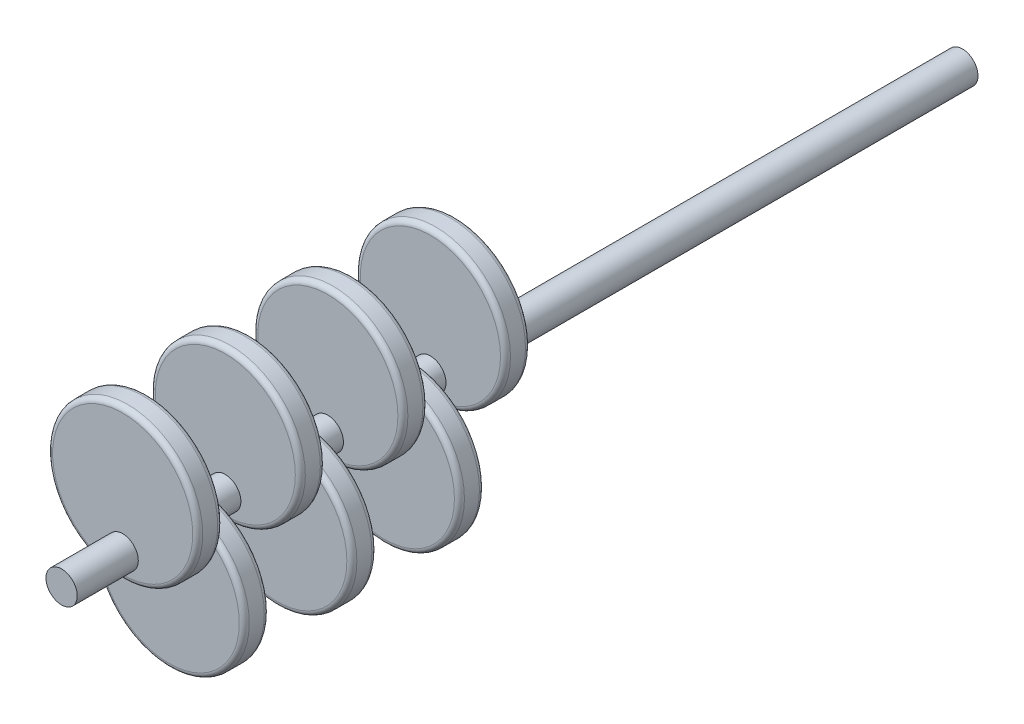
ISO-10303-21;
HEADER;
FILE_DESCRIPTION(('STEP AP214'),'2;1');
FILE_NAME('part.step','',(''),(''),'','','');
FILE_SCHEMA(('AUTOMOTIVE_DESIGN { 1 0 10303 214 1 1 1 1 }'));
ENDSEC;
DATA;
#1=APPLICATION_CONTEXT('core data for automotive mechanical design processes');
#2=APPLICATION_PROTOCOL_DEFINITION('international standard','automotive_design',2000,#1);
#3=PRODUCT_CONTEXT('',#1,'mechanical');
#4=PRODUCT('Part','Part','',(#3));
#5=PRODUCT_RELATED_PRODUCT_CATEGORY('part','',(#4));
#6=PRODUCT_DEFINITION_FORMATION('','',#4);
#7=PRODUCT_DEFINITION_CONTEXT('part definition',#1,'design');
#8=PRODUCT_DEFINITION('design','',#6,#7);
#9=PRODUCT_DEFINITION_SHAPE('','',#8);
#10=(LENGTH_UNIT() NAMED_UNIT(*) SI_UNIT(.MILLI.,.METRE.));
#11=(NAMED_UNIT(*) PLANE_ANGLE_UNIT() SI_UNIT($,.RADIAN.));
#12=(NAMED_UNIT(*) SI_UNIT($,.STERADIAN.) SOLID_ANGLE_UNIT());
#13=UNCERTAINTY_MEASURE_WITH_UNIT(LENGTH_MEASURE(1.E-05),#10,'distance_accuracy_value','');
#14=(GEOMETRIC_REPRESENTATION_CONTEXT(3) GLOBAL_UNCERTAINTY_ASSIGNED_CONTEXT((#13)) GLOBAL_UNIT_ASSIGNED_CONTEXT((#10,
#11,#12)) REPRESENTATION_CONTEXT('',''));
#15=CARTESIAN_POINT('',(0.,0.,0.));
#16=DIRECTION('',(0.,0.,1.));
#17=DIRECTION('',(1.,0.,0.));
#18=AXIS2_PLACEMENT_3D('',#15,#16,#17);
#19=CARTESIAN_POINT('',(0.,0.,90.));
#20=DIRECTION('',(0.,0.,-1.));
#21=DIRECTION('',(-1.,0.,0.));
#22=AXIS2_PLACEMENT_3D('',#19,#20,#21);
#23=CYLINDRICAL_SURFACE('',#22,3.125);
#24=CARTESIAN_POINT('',(0.,0.,57.3));
#25=DIRECTION('',(0.,0.,1.));
#26=DIRECTION('',(1.,0.,0.));
#27=AXIS2_PLACEMENT_3D('',#24,#25,#26);
#28=CIRCLE('',#27,3.125);
#29=CARTESIAN_POINT('',(3.125,0.,57.3));
#30=VERTEX_POINT('',#29);
#31=EDGE_CURVE('E156',#30,#30,#28,.T.);
#32=ORIENTED_EDGE('',*,*,#31,.T.);
#33=EDGE_LOOP('',(#32));
#34=FACE_BOUND('',#33,.T.);
#35=CARTESIAN_POINT('',(0.,0.,63.5));
#36=DIRECTION('',(0.,0.,1.));
#37=DIRECTION('',(1.,0.,0.));
#38=AXIS2_PLACEMENT_3D('',#35,#36,#37);
#39=CIRCLE('',#38,3.125);
#40=CARTESIAN_POINT('',(3.125,0.,63.5));
#41=VERTEX_POINT('',#40);
#42=EDGE_CURVE('E135',#41,#41,#39,.T.);
#43=ORIENTED_EDGE('',*,*,#42,.F.);
#44=EDGE_LOOP('',(#43));
#45=FACE_BOUND('',#44,.T.);
#46=ADVANCED_FACE('F33',(#34,#45),#23,.T.);
#47=CARTESIAN_POINT('',(0.,10.,52.3));
#48=DIRECTION('',(0.,0.,1.));
#49=DIRECTION('',(1.,0.,0.));
#50=AXIS2_PLACEMENT_3D('',#47,#48,#49);
#51=CYLINDRICAL_SURFACE('',#50,15.);
#52=CARTESIAN_POINT('',(0.,10.,53.3));
#53=DIRECTION('',(0.,0.,1.));
#54=DIRECTION('',(1.,0.,0.));
#55=AXIS2_PLACEMENT_3D('',#52,#53,#54);
#56=CIRCLE('',#55,15.);
#57=CARTESIAN_POINT('',(15.,10.,53.3));
#58=VERTEX_POINT('',#57);
#59=EDGE_CURVE('E71',#58,#58,#56,.T.);
#60=ORIENTED_EDGE('',*,*,#59,.T.);
#61=EDGE_LOOP('',(#60));
#62=FACE_BOUND('',#61,.T.);
#63=CARTESIAN_POINT('',(0.,10.,56.3));
#64=DIRECTION('',(0.,0.,1.));
#65=DIRECTION('',(1.,0.,0.));
#66=AXIS2_PLACEMENT_3D('',#63,#64,#65);
#67=CIRCLE('',#66,15.);
#68=CARTESIAN_POINT('',(15.,10.,56.3));
#69=VERTEX_POINT('',#68);
#70=EDGE_CURVE('E74',#69,#69,#67,.F.);
#71=ORIENTED_EDGE('',*,*,#70,.T.);
#72=EDGE_LOOP('',(#71));
#73=FACE_BOUND('',#72,.T.);
#74=ADVANCED_FACE('F204',(#62,#73),#51,.T.);
#75=CARTESIAN_POINT('',(0.,10.,52.3));
#76=DIRECTION('',(0.,0.,1.));
#77=DIRECTION('',(1.,0.,0.));
#78=AXIS2_PLACEMENT_3D('',#75,#76,#77);
#79=PLANE('',#78);
#80=CARTESIAN_POINT('',(0.,10.,52.3));
#81=DIRECTION('',(0.,0.,1.));
#82=DIRECTION('',(1.,0.,0.));
#83=AXIS2_PLACEMENT_3D('',#80,#81,#82);
#84=CIRCLE('',#83,14.);
#85=CARTESIAN_POINT('',(14.,10.,52.3));
#86=VERTEX_POINT('',#85);
#87=EDGE_CURVE('E68',#86,#86,#84,.F.);
#88=ORIENTED_EDGE('',*,*,#87,.T.);
#89=EDGE_LOOP('',(#88));
#90=FACE_BOUND('',#89,.T.);
#91=CARTESIAN_POINT('',(0.,0.,52.3));
#92=DIRECTION('',(0.,0.,1.));
#93=DIRECTION('',(1.,0.,0.));
#94=AXIS2_PLACEMENT_3D('',#91,#92,#93);
#95=CIRCLE('',#94,3.125);
#96=CARTESIAN_POINT('',(3.125,0.,52.3));
#97=VERTEX_POINT('',#96);
#98=EDGE_CURVE('E153',#97,#97,#95,.T.);
#99=ORIENTED_EDGE('',*,*,#98,.T.);
#100=EDGE_LOOP('',(#99));
#101=FACE_BOUND('',#100,.T.);
#102=ADVANCED_FACE('F210',(#90,#101),#79,.F.);
#103=CARTESIAN_POINT('',(0.,10.,57.3));
#104=DIRECTION('',(0.,0.,1.));
#105=DIRECTION('',(1.,0.,0.));
#106=AXIS2_PLACEMENT_3D('',#103,#104,#105);
#107=PLANE('',#106);
#108=CARTESIAN_POINT('',(0.,10.,57.3));
#109=DIRECTION('',(0.,0.,1.));
#110=DIRECTION('',(1.,0.,0.));
#111=AXIS2_PLACEMENT_3D('',#108,#109,#110);
#112=CIRCLE('',#111,14.);
#113=CARTESIAN_POINT('',(14.,10.,57.3));
#114=VERTEX_POINT('',#113);
#115=EDGE_CURVE('E65',#114,#114,#112,.T.);
#116=ORIENTED_EDGE('',*,*,#115,.T.);
#117=EDGE_LOOP('',(#116));
#118=FACE_BOUND('',#117,.T.);
#119=ORIENTED_EDGE('',*,*,#31,.F.);
#120=EDGE_LOOP('',(#119));
#121=FACE_BOUND('',#120,.T.);
#122=ADVANCED_FACE('F282',(#118,#121),#107,.T.);
#123=CARTESIAN_POINT('',(0.,0.,47.));
#124=DIRECTION('',(0.,0.,1.));
#125=DIRECTION('',(1.,0.,0.));
#126=AXIS2_PLACEMENT_3D('',#123,#124,#125);
#127=CIRCLE('',#126,3.125);
#128=CARTESIAN_POINT('',(3.125,0.,47.));
#129=VERTEX_POINT('',#128);
#130=EDGE_CURVE('E132',#129,#129,#127,.T.);
#131=ORIENTED_EDGE('',*,*,#130,.T.);
#132=EDGE_LOOP('',(#131));
#133=FACE_BOUND('',#132,.T.);
#134=ORIENTED_EDGE('',*,*,#98,.F.);
#135=EDGE_LOOP('',(#134));
#136=FACE_BOUND('',#135,.T.);
#137=ADVANCED_FACE('F202',(#133,#136),#23,.T.);
#138=CARTESIAN_POINT('',(0.,-10.,63.5));
#139=DIRECTION('',(0.,0.,1.));
#140=DIRECTION('',(1.,0.,0.));
#141=AXIS2_PLACEMENT_3D('',#138,#139,#140);
#142=CYLINDRICAL_SURFACE('',#141,15.);
#143=CARTESIAN_POINT('',(0.,-10.,64.5));
#144=DIRECTION('',(0.,0.,1.));
#145=DIRECTION('',(1.,0.,0.));
#146=AXIS2_PLACEMENT_3D('',#143,#144,#145);
#147=CIRCLE('',#146,15.);
#148=CARTESIAN_POINT('',(15.,-10.,64.5));
#149=VERTEX_POINT('',#148);
#150=EDGE_CURVE('E59',#149,#149,#147,.T.);
#151=ORIENTED_EDGE('',*,*,#150,.T.);
#152=EDGE_LOOP('',(#151));
#153=FACE_BOUND('',#152,.T.);
#154=CARTESIAN_POINT('',(0.,-10.,67.5));
#155=DIRECTION('',(0.,0.,1.));
#156=DIRECTION('',(1.,0.,0.));
#157=AXIS2_PLACEMENT_3D('',#154,#155,#156);
#158=CIRCLE('',#157,15.);
#159=CARTESIAN_POINT('',(15.,-10.,67.5));
#160=VERTEX_POINT('',#159);
#161=EDGE_CURVE('E62',#160,#160,#158,.F.);
#162=ORIENTED_EDGE('',*,*,#161,.T.);
#163=EDGE_LOOP('',(#162));
#164=FACE_BOUND('',#163,.T.);
#165=ADVANCED_FACE('F255',(#153,#164),#142,.T.);
#166=CARTESIAN_POINT('',(0.,-10.,63.5));
#167=DIRECTION('',(0.,0.,1.));
#168=DIRECTION('',(1.,0.,0.));
#169=AXIS2_PLACEMENT_3D('',#166,#167,#168);
#170=PLANE('',#169);
#171=CARTESIAN_POINT('',(0.,-10.,63.5));
#172=DIRECTION('',(0.,0.,1.));
#173=DIRECTION('',(1.,0.,0.));
#174=AXIS2_PLACEMENT_3D('',#171,#172,#173);
#175=CIRCLE('',#174,14.);
#176=CARTESIAN_POINT('',(14.,-10.,63.5));
#177=VERTEX_POINT('',#176);
#178=EDGE_CURVE('E56',#177,#177,#175,.F.);
#179=ORIENTED_EDGE('',*,*,#178,.T.);
#180=EDGE_LOOP('',(#179));
#181=FACE_BOUND('',#180,.T.);
#182=ORIENTED_EDGE('',*,*,#42,.T.);
#183=EDGE_LOOP('',(#182));
#184=FACE_BOUND('',#183,.T.);
#185=ADVANCED_FACE('F252',(#181,#184),#170,.F.);
#186=CARTESIAN_POINT('',(0.,-10.,68.5));
#187=DIRECTION('',(0.,0.,1.));
#188=DIRECTION('',(1.,0.,0.));
#189=AXIS2_PLACEMENT_3D('',#186,#187,#188);
#190=PLANE('',#189);
#191=CARTESIAN_POINT('',(0.,-10.,68.5));
#192=DIRECTION('',(0.,0.,1.));
#193=DIRECTION('',(1.,0.,0.));
#194=AXIS2_PLACEMENT_3D('',#191,#192,#193);
#195=CIRCLE('',#194,14.);
#196=CARTESIAN_POINT('',(14.,-10.,68.5));
#197=VERTEX_POINT('',#196);
#198=EDGE_CURVE('E53',#197,#197,#195,.T.);
#199=ORIENTED_EDGE('',*,*,#198,.T.);
#200=EDGE_LOOP('',(#199));
#201=FACE_BOUND('',#200,.T.);
#202=CARTESIAN_POINT('',(0.,0.,68.5));
#203=DIRECTION('',(0.,0.,1.));
#204=DIRECTION('',(1.,0.,0.));
#205=AXIS2_PLACEMENT_3D('',#202,#203,#204);
#206=CIRCLE('',#205,3.125);
#207=CARTESIAN_POINT('',(3.125,0.,68.5));
#208=VERTEX_POINT('',#207);
#209=EDGE_CURVE('E138',#208,#208,#206,.T.);
#210=ORIENTED_EDGE('',*,*,#209,.F.);
#211=EDGE_LOOP('',(#210));
#212=FACE_BOUND('',#211,.T.);
#213=ADVANCED_FACE('F189',(#201,#212),#190,.T.);
#214=CARTESIAN_POINT('',(0.,0.,90.));
#215=DIRECTION('',(0.,0.,1.));
#216=DIRECTION('',(1.,0.,0.));
#217=AXIS2_PLACEMENT_3D('',#214,#215,#216);
#218=PLANE('',#217);
#219=CARTESIAN_POINT('',(0.,0.,90.));
#220=DIRECTION('',(0.,0.,1.));
#221=DIRECTION('',(1.,0.,0.));
#222=AXIS2_PLACEMENT_3D('',#219,#220,#221);
#223=CIRCLE('',#222,3.125);
#224=CARTESIAN_POINT('',(3.125,0.,90.));
#225=VERTEX_POINT('',#224);
#226=EDGE_CURVE('E165',#225,#225,#223,.T.);
#227=ORIENTED_EDGE('',*,*,#226,.T.);
#228=EDGE_LOOP('',(#227));
#229=FACE_BOUND('',#228,.T.);
#230=ADVANCED_FACE('F174',(#229),#218,.T.);
#231=CARTESIAN_POINT('',(0.,0.,77.8));
#232=DIRECTION('',(0.,0.,1.));
#233=DIRECTION('',(1.,0.,0.));
#234=AXIS2_PLACEMENT_3D('',#231,#232,#233);
#235=CIRCLE('',#234,3.125);
#236=CARTESIAN_POINT('',(3.125,0.,77.8));
#237=VERTEX_POINT('',#236);
#238=EDGE_CURVE('E162',#237,#237,#235,.T.);
#239=ORIENTED_EDGE('',*,*,#238,.T.);
#240=EDGE_LOOP('',(#239));
#241=FACE_BOUND('',#240,.T.);
#242=ORIENTED_EDGE('',*,*,#226,.F.);
#243=EDGE_LOOP('',(#242));
#244=FACE_BOUND('',#243,.T.);
#245=ADVANCED_FACE('F176',(#241,#244),#23,.T.);
#246=CARTESIAN_POINT('',(0.,10.,77.8));
#247=DIRECTION('',(0.,0.,1.));
#248=DIRECTION('',(1.,0.,0.));
#249=AXIS2_PLACEMENT_3D('',#246,#247,#248);
#250=PLANE('',#249);
#251=CARTESIAN_POINT('',(0.,10.,77.8));
#252=DIRECTION('',(0.,0.,1.));
#253=DIRECTION('',(1.,0.,0.));
#254=AXIS2_PLACEMENT_3D('',#251,#252,#253);
#255=CIRCLE('',#254,14.);
#256=CARTESIAN_POINT('',(14.,10.,77.8));
#257=VERTEX_POINT('',#256);
#258=EDGE_CURVE('E10',#257,#257,#255,.T.);
#259=ORIENTED_EDGE('',*,*,#258,.T.);
#260=EDGE_LOOP('',(#259));
#261=FACE_BOUND('',#260,.T.);
#262=ORIENTED_EDGE('',*,*,#238,.F.);
#263=EDGE_LOOP('',(#262));
#264=FACE_BOUND('',#263,.T.);
#265=ADVANCED_FACE('F178',(#261,#264),#250,.T.);
#266=CARTESIAN_POINT('',(0.,10.,72.8));
#267=DIRECTION('',(0.,0.,1.));
#268=DIRECTION('',(1.,0.,0.));
#269=AXIS2_PLACEMENT_3D('',#266,#267,#268);
#270=CYLINDRICAL_SURFACE('',#269,15.);
#271=CARTESIAN_POINT('',(0.,10.,73.8));
#272=DIRECTION('',(0.,0.,1.));
#273=DIRECTION('',(1.,0.,0.));
#274=AXIS2_PLACEMENT_3D('',#271,#272,#273);
#275=CIRCLE('',#274,15.);
#276=CARTESIAN_POINT('',(15.,10.,73.8));
#277=VERTEX_POINT('',#276);
#278=EDGE_CURVE('E44',#277,#277,#275,.T.);
#279=ORIENTED_EDGE('',*,*,#278,.T.);
#280=EDGE_LOOP('',(#279));
#281=FACE_BOUND('',#280,.T.);
#282=CARTESIAN_POINT('',(0.,10.,76.8));
#283=DIRECTION('',(0.,0.,1.));
#284=DIRECTION('',(1.,0.,0.));
#285=AXIS2_PLACEMENT_3D('',#282,#283,#284);
#286=CIRCLE('',#285,15.);
#287=CARTESIAN_POINT('',(15.,10.,76.8));
#288=VERTEX_POINT('',#287);
#289=EDGE_CURVE('E48',#288,#288,#286,.F.);
#290=ORIENTED_EDGE('',*,*,#289,.T.);
#291=EDGE_LOOP('',(#290));
#292=FACE_BOUND('',#291,.T.);
#293=ADVANCED_FACE('F187',(#281,#292),#270,.T.);
#294=CARTESIAN_POINT('',(0.,10.,72.8));
#295=DIRECTION('',(0.,0.,1.));
#296=DIRECTION('',(1.,0.,0.));
#297=AXIS2_PLACEMENT_3D('',#294,#295,#296);
#298=PLANE('',#297);
#299=CARTESIAN_POINT('',(0.,10.,72.8));
#300=DIRECTION('',(0.,0.,1.));
#301=DIRECTION('',(1.,0.,0.));
#302=AXIS2_PLACEMENT_3D('',#299,#300,#301);
#303=CIRCLE('',#302,14.);
#304=CARTESIAN_POINT('',(14.,10.,72.8));
#305=VERTEX_POINT('',#304);
#306=EDGE_CURVE('E40',#305,#305,#303,.F.);
#307=ORIENTED_EDGE('',*,*,#306,.T.);
#308=EDGE_LOOP('',(#307));
#309=FACE_BOUND('',#308,.T.);
#310=CARTESIAN_POINT('',(0.,0.,72.8));
#311=DIRECTION('',(0.,0.,1.));
#312=DIRECTION('',(1.,0.,0.));
#313=AXIS2_PLACEMENT_3D('',#310,#311,#312);
#314=CIRCLE('',#313,3.125);
#315=CARTESIAN_POINT('',(3.125,0.,72.8));
#316=VERTEX_POINT('',#315);
#317=EDGE_CURVE('E159',#316,#316,#314,.T.);
#318=ORIENTED_EDGE('',*,*,#317,.T.);
#319=EDGE_LOOP('',(#318));
#320=FACE_BOUND('',#319,.T.);
#321=ADVANCED_FACE('F200',(#309,#320),#298,.F.);
#322=ORIENTED_EDGE('',*,*,#209,.T.);
#323=EDGE_LOOP('',(#322));
#324=FACE_BOUND('',#323,.T.);
#325=ORIENTED_EDGE('',*,*,#317,.F.);
#326=EDGE_LOOP('',(#325));
#327=FACE_BOUND('',#326,.T.);
#328=ADVANCED_FACE('F182',(#324,#327),#23,.T.);
#329=CARTESIAN_POINT('',(0.,-10.,42.));
#330=DIRECTION('',(0.,0.,1.));
#331=DIRECTION('',(1.,0.,0.));
#332=AXIS2_PLACEMENT_3D('',#329,#330,#331);
#333=CYLINDRICAL_SURFACE('',#332,15.);
#334=CARTESIAN_POINT('',(0.,-10.,43.));
#335=DIRECTION('',(0.,0.,1.));
#336=DIRECTION('',(1.,0.,0.));
#337=AXIS2_PLACEMENT_3D('',#334,#335,#336);
#338=CIRCLE('',#337,15.);
#339=CARTESIAN_POINT('',(15.,-10.,43.));
#340=VERTEX_POINT('',#339);
#341=EDGE_CURVE('E83',#340,#340,#338,.T.);
#342=ORIENTED_EDGE('',*,*,#341,.T.);
#343=EDGE_LOOP('',(#342));
#344=FACE_BOUND('',#343,.T.);
#345=CARTESIAN_POINT('',(0.,-10.,46.));
#346=DIRECTION('',(0.,0.,1.));
#347=DIRECTION('',(1.,0.,0.));
#348=AXIS2_PLACEMENT_3D('',#345,#346,#347);
#349=CIRCLE('',#348,15.);
#350=CARTESIAN_POINT('',(15.,-10.,46.));
#351=VERTEX_POINT('',#350);
#352=EDGE_CURVE('E86',#351,#351,#349,.F.);
#353=ORIENTED_EDGE('',*,*,#352,.T.);
#354=EDGE_LOOP('',(#353));
#355=FACE_BOUND('',#354,.T.);
#356=ADVANCED_FACE('F199',(#344,#355),#333,.T.);
#357=CARTESIAN_POINT('',(0.,-10.,42.));
#358=DIRECTION('',(0.,0.,1.));
#359=DIRECTION('',(1.,0.,0.));
#360=AXIS2_PLACEMENT_3D('',#357,#358,#359);
#361=PLANE('',#360);
#362=CARTESIAN_POINT('',(0.,-10.,42.));
#363=DIRECTION('',(0.,0.,1.));
#364=DIRECTION('',(1.,0.,0.));
#365=AXIS2_PLACEMENT_3D('',#362,#363,#364);
#366=CIRCLE('',#365,14.);
#367=CARTESIAN_POINT('',(14.,-10.,42.));
#368=VERTEX_POINT('',#367);
#369=EDGE_CURVE('E80',#368,#368,#366,.F.);
#370=ORIENTED_EDGE('',*,*,#369,.T.);
#371=EDGE_LOOP('',(#370));
#372=FACE_BOUND('',#371,.T.);
#373=CARTESIAN_POINT('',(0.,0.,42.));
#374=DIRECTION('',(0.,0.,1.));
#375=DIRECTION('',(1.,0.,0.));
#376=AXIS2_PLACEMENT_3D('',#373,#374,#375);
#377=CIRCLE('',#376,3.125);
#378=CARTESIAN_POINT('',(3.125,0.,42.));
#379=VERTEX_POINT('',#378);
#380=EDGE_CURVE('E128',#379,#379,#377,.T.);
#381=ORIENTED_EDGE('',*,*,#380,.T.);
#382=EDGE_LOOP('',(#381));
#383=FACE_BOUND('',#382,.T.);
#384=ADVANCED_FACE('F237',(#372,#383),#361,.F.);
#385=CARTESIAN_POINT('',(0.,-10.,47.));
#386=DIRECTION('',(0.,0.,1.));
#387=DIRECTION('',(1.,0.,0.));
#388=AXIS2_PLACEMENT_3D('',#385,#386,#387);
#389=PLANE('',#388);
#390=CARTESIAN_POINT('',(0.,-10.,47.));
#391=DIRECTION('',(0.,0.,1.));
#392=DIRECTION('',(1.,0.,0.));
#393=AXIS2_PLACEMENT_3D('',#390,#391,#392);
#394=CIRCLE('',#393,14.);
#395=CARTESIAN_POINT('',(14.,-10.,47.));
#396=VERTEX_POINT('',#395);
#397=EDGE_CURVE('E77',#396,#396,#394,.T.);
#398=ORIENTED_EDGE('',*,*,#397,.T.);
#399=EDGE_LOOP('',(#398));
#400=FACE_BOUND('',#399,.T.);
#401=ORIENTED_EDGE('',*,*,#130,.F.);
#402=EDGE_LOOP('',(#401));
#403=FACE_BOUND('',#402,.T.);
#404=ADVANCED_FACE('F239',(#400,#403),#389,.T.);
#405=CARTESIAN_POINT('',(0.,0.,25.5));
#406=DIRECTION('',(0.,0.,1.));
#407=DIRECTION('',(1.,0.,0.));
#408=AXIS2_PLACEMENT_3D('',#405,#406,#407);
#409=CIRCLE('',#408,3.125);
#410=CARTESIAN_POINT('',(3.125,0.,25.5));
#411=VERTEX_POINT('',#410);
#412=EDGE_CURVE('E129',#411,#411,#409,.T.);
#413=ORIENTED_EDGE('',*,*,#412,.T.);
#414=EDGE_LOOP('',(#413));
#415=FACE_BOUND('',#414,.T.);
#416=CARTESIAN_POINT('',(0.,0.,31.8));
#417=DIRECTION('',(0.,0.,1.));
#418=DIRECTION('',(1.,0.,0.));
#419=AXIS2_PLACEMENT_3D('',#416,#417,#418);
#420=CIRCLE('',#419,3.125);
#421=CARTESIAN_POINT('',(3.125,0.,31.8));
#422=VERTEX_POINT('',#421);
#423=EDGE_CURVE('E147',#422,#422,#420,.T.);
#424=ORIENTED_EDGE('',*,*,#423,.F.);
#425=EDGE_LOOP('',(#424));
#426=FACE_BOUND('',#425,.T.);
#427=ADVANCED_FACE('F218',(#415,#426),#23,.T.);
#428=CARTESIAN_POINT('',(0.,10.,31.8));
#429=DIRECTION('',(0.,0.,1.));
#430=DIRECTION('',(1.,0.,0.));
#431=AXIS2_PLACEMENT_3D('',#428,#429,#430);
#432=PLANE('',#431);
#433=CARTESIAN_POINT('',(0.,10.,31.8));
#434=DIRECTION('',(0.,0.,1.));
#435=DIRECTION('',(1.,0.,0.));
#436=AXIS2_PLACEMENT_3D('',#433,#434,#435);
#437=CIRCLE('',#436,14.);
#438=CARTESIAN_POINT('',(14.,10.,31.8));
#439=VERTEX_POINT('',#438);
#440=EDGE_CURVE('E92',#439,#439,#437,.F.);
#441=ORIENTED_EDGE('',*,*,#440,.T.);
#442=EDGE_LOOP('',(#441));
#443=FACE_BOUND('',#442,.T.);
#444=ORIENTED_EDGE('',*,*,#423,.T.);
#445=EDGE_LOOP('',(#444));
#446=FACE_BOUND('',#445,.T.);
#447=ADVANCED_FACE('F273',(#443,#446),#432,.F.);
#448=CARTESIAN_POINT('',(0.,10.,31.8));
#449=DIRECTION('',(0.,0.,1.));
#450=DIRECTION('',(1.,0.,0.));
#451=AXIS2_PLACEMENT_3D('',#448,#449,#450);
#452=CYLINDRICAL_SURFACE('',#451,15.);
#453=CARTESIAN_POINT('',(0.,10.,32.8));
#454=DIRECTION('',(0.,0.,1.));
#455=DIRECTION('',(1.,0.,0.));
#456=AXIS2_PLACEMENT_3D('',#453,#454,#455);
#457=CIRCLE('',#456,15.);
#458=CARTESIAN_POINT('',(15.,10.,32.8));
#459=VERTEX_POINT('',#458);
#460=EDGE_CURVE('E95',#459,#459,#457,.T.);
#461=ORIENTED_EDGE('',*,*,#460,.T.);
#462=EDGE_LOOP('',(#461));
#463=FACE_BOUND('',#462,.T.);
#464=CARTESIAN_POINT('',(0.,10.,35.8));
#465=DIRECTION('',(0.,0.,1.));
#466=DIRECTION('',(1.,0.,0.));
#467=AXIS2_PLACEMENT_3D('',#464,#465,#466);
#468=CIRCLE('',#467,15.);
#469=CARTESIAN_POINT('',(15.,10.,35.8));
#470=VERTEX_POINT('',#469);
#471=EDGE_CURVE('E98',#470,#470,#468,.F.);
#472=ORIENTED_EDGE('',*,*,#471,.T.);
#473=EDGE_LOOP('',(#472));
#474=FACE_BOUND('',#473,.T.);
#475=ADVANCED_FACE('F230',(#463,#474),#452,.T.);
#476=CARTESIAN_POINT('',(0.,10.,36.8));
#477=DIRECTION('',(0.,0.,1.));
#478=DIRECTION('',(1.,0.,0.));
#479=AXIS2_PLACEMENT_3D('',#476,#477,#478);
#480=PLANE('',#479);
#481=CARTESIAN_POINT('',(0.,10.,36.8));
#482=DIRECTION('',(0.,0.,1.));
#483=DIRECTION('',(1.,0.,0.));
#484=AXIS2_PLACEMENT_3D('',#481,#482,#483);
#485=CIRCLE('',#484,14.);
#486=CARTESIAN_POINT('',(14.,10.,36.8));
#487=VERTEX_POINT('',#486);
#488=EDGE_CURVE('E89',#487,#487,#485,.T.);
#489=ORIENTED_EDGE('',*,*,#488,.T.);
#490=EDGE_LOOP('',(#489));
#491=FACE_BOUND('',#490,.T.);
#492=CARTESIAN_POINT('',(0.,0.,36.8));
#493=DIRECTION('',(0.,0.,1.));
#494=DIRECTION('',(1.,0.,0.));
#495=AXIS2_PLACEMENT_3D('',#492,#493,#494);
#496=CIRCLE('',#495,3.125);
#497=CARTESIAN_POINT('',(3.125,0.,36.8));
#498=VERTEX_POINT('',#497);
#499=EDGE_CURVE('E150',#498,#498,#496,.T.);
#500=ORIENTED_EDGE('',*,*,#499,.F.);
#501=EDGE_LOOP('',(#500));
#502=FACE_BOUND('',#501,.T.);
#503=ADVANCED_FACE('F221',(#491,#502),#480,.T.);
#504=ORIENTED_EDGE('',*,*,#499,.T.);
#505=EDGE_LOOP('',(#504));
#506=FACE_BOUND('',#505,.T.);
#507=ORIENTED_EDGE('',*,*,#380,.F.);
#508=EDGE_LOOP('',(#507));
#509=FACE_BOUND('',#508,.T.);
#510=ADVANCED_FACE('F197',(#506,#509),#23,.T.);
#511=CARTESIAN_POINT('',(0.,-10.,20.5));
#512=DIRECTION('',(0.,0.,1.));
#513=DIRECTION('',(1.,0.,0.));
#514=AXIS2_PLACEMENT_3D('',#511,#512,#513);
#515=CYLINDRICAL_SURFACE('',#514,15.);
#516=CARTESIAN_POINT('',(0.,-10.,21.5));
#517=DIRECTION('',(0.,0.,1.));
#518=DIRECTION('',(1.,0.,0.));
#519=AXIS2_PLACEMENT_3D('',#516,#517,#518);
#520=CIRCLE('',#519,15.);
#521=CARTESIAN_POINT('',(15.,-10.,21.5));
#522=VERTEX_POINT('',#521);
#523=EDGE_CURVE('E107',#522,#522,#520,.T.);
#524=ORIENTED_EDGE('',*,*,#523,.T.);
#525=EDGE_LOOP('',(#524));
#526=FACE_BOUND('',#525,.T.);
#527=CARTESIAN_POINT('',(0.,-10.,24.5));
#528=DIRECTION('',(0.,0.,1.));
#529=DIRECTION('',(1.,0.,0.));
#530=AXIS2_PLACEMENT_3D('',#527,#528,#529);
#531=CIRCLE('',#530,15.);
#532=CARTESIAN_POINT('',(15.,-10.,24.5));
#533=VERTEX_POINT('',#532);
#534=EDGE_CURVE('E110',#533,#533,#531,.F.);
#535=ORIENTED_EDGE('',*,*,#534,.T.);
#536=EDGE_LOOP('',(#535));
#537=FACE_BOUND('',#536,.T.);
#538=ADVANCED_FACE('F220',(#526,#537),#515,.T.);
#539=CARTESIAN_POINT('',(0.,-10.,20.5));
#540=DIRECTION('',(0.,0.,1.));
#541=DIRECTION('',(1.,0.,0.));
#542=AXIS2_PLACEMENT_3D('',#539,#540,#541);
#543=PLANE('',#542);
#544=CARTESIAN_POINT('',(0.,-10.,20.5));
#545=DIRECTION('',(0.,0.,1.));
#546=DIRECTION('',(1.,0.,0.));
#547=AXIS2_PLACEMENT_3D('',#544,#545,#546);
#548=CIRCLE('',#547,14.);
#549=CARTESIAN_POINT('',(14.,-10.,20.5));
#550=VERTEX_POINT('',#549);
#551=EDGE_CURVE('E104',#550,#550,#548,.F.);
#552=ORIENTED_EDGE('',*,*,#551,.T.);
#553=EDGE_LOOP('',(#552));
#554=FACE_BOUND('',#553,.T.);
#555=CARTESIAN_POINT('',(0.,0.,20.5));
#556=DIRECTION('',(0.,0.,1.));
#557=DIRECTION('',(1.,0.,0.));
#558=AXIS2_PLACEMENT_3D('',#555,#556,#557);
#559=CIRCLE('',#558,3.125);
#560=CARTESIAN_POINT('',(3.125,0.,20.5));
#561=VERTEX_POINT('',#560);
#562=EDGE_CURVE('E125',#561,#561,#559,.T.);
#563=ORIENTED_EDGE('',*,*,#562,.T.);
#564=EDGE_LOOP('',(#563));
#565=FACE_BOUND('',#564,.T.);
#566=ADVANCED_FACE('F227',(#554,#565),#543,.F.);
#567=CARTESIAN_POINT('',(0.,-10.,25.5));
#568=DIRECTION('',(0.,0.,1.));
#569=DIRECTION('',(1.,0.,0.));
#570=AXIS2_PLACEMENT_3D('',#567,#568,#569);
#571=PLANE('',#570);
#572=CARTESIAN_POINT('',(0.,-10.,25.5));
#573=DIRECTION('',(0.,0.,1.));
#574=DIRECTION('',(1.,0.,0.));
#575=AXIS2_PLACEMENT_3D('',#572,#573,#574);
#576=CIRCLE('',#575,14.);
#577=CARTESIAN_POINT('',(14.,-10.,25.5));
#578=VERTEX_POINT('',#577);
#579=EDGE_CURVE('E101',#578,#578,#576,.T.);
#580=ORIENTED_EDGE('',*,*,#579,.T.);
#581=EDGE_LOOP('',(#580));
#582=FACE_BOUND('',#581,.T.);
#583=ORIENTED_EDGE('',*,*,#412,.F.);
#584=EDGE_LOOP('',(#583));
#585=FACE_BOUND('',#584,.T.);
#586=ADVANCED_FACE('F292',(#582,#585),#571,.T.);
#587=CARTESIAN_POINT('',(0.,0.,-90.));
#588=DIRECTION('',(0.,0.,1.));
#589=DIRECTION('',(1.,0.,0.));
#590=AXIS2_PLACEMENT_3D('',#587,#588,#589);
#591=PLANE('',#590);
#592=CARTESIAN_POINT('',(0.,0.,-90.));
#593=DIRECTION('',(0.,0.,1.));
#594=DIRECTION('',(1.,0.,0.));
#595=AXIS2_PLACEMENT_3D('',#592,#593,#594);
#596=CIRCLE('',#595,3.125);
#597=CARTESIAN_POINT('',(3.125,0.,-90.));
#598=VERTEX_POINT('',#597);
#599=EDGE_CURVE('E168',#598,#598,#596,.T.);
#600=ORIENTED_EDGE('',*,*,#599,.F.);
#601=EDGE_LOOP('',(#600));
#602=FACE_BOUND('',#601,.T.);
#603=ADVANCED_FACE('F216',(#602),#591,.F.);
#604=ORIENTED_EDGE('',*,*,#599,.T.);
#605=EDGE_LOOP('',(#604));
#606=FACE_BOUND('',#605,.T.);
#607=CARTESIAN_POINT('',(0.,0.,11.3));
#608=DIRECTION('',(0.,0.,1.));
#609=DIRECTION('',(1.,0.,0.));
#610=AXIS2_PLACEMENT_3D('',#607,#608,#609);
#611=CIRCLE('',#610,3.125);
#612=CARTESIAN_POINT('',(3.125,0.,11.3));
#613=VERTEX_POINT('',#612);
#614=EDGE_CURVE('E141',#613,#613,#611,.T.);
#615=ORIENTED_EDGE('',*,*,#614,.F.);
#616=EDGE_LOOP('',(#615));
#617=FACE_BOUND('',#616,.T.);
#618=ADVANCED_FACE('F206',(#606,#617),#23,.T.);
#619=CARTESIAN_POINT('',(0.,10.,11.3));
#620=DIRECTION('',(0.,0.,1.));
#621=DIRECTION('',(1.,0.,0.));
#622=AXIS2_PLACEMENT_3D('',#619,#620,#621);
#623=PLANE('',#622);
#624=CARTESIAN_POINT('',(0.,10.,11.3));
#625=DIRECTION('',(0.,0.,1.));
#626=DIRECTION('',(1.,0.,0.));
#627=AXIS2_PLACEMENT_3D('',#624,#625,#626);
#628=CIRCLE('',#627,14.);
#629=CARTESIAN_POINT('',(14.,10.,11.3));
#630=VERTEX_POINT('',#629);
#631=EDGE_CURVE('E116',#630,#630,#628,.F.);
#632=ORIENTED_EDGE('',*,*,#631,.T.);
#633=EDGE_LOOP('',(#632));
#634=FACE_BOUND('',#633,.T.);
#635=ORIENTED_EDGE('',*,*,#614,.T.);
#636=EDGE_LOOP('',(#635));
#637=FACE_BOUND('',#636,.T.);
#638=ADVANCED_FACE('F215',(#634,#637),#623,.F.);
#639=CARTESIAN_POINT('',(0.,10.,11.3));
#640=DIRECTION('',(0.,0.,1.));
#641=DIRECTION('',(1.,0.,0.));
#642=AXIS2_PLACEMENT_3D('',#639,#640,#641);
#643=CYLINDRICAL_SURFACE('',#642,15.);
#644=CARTESIAN_POINT('',(0.,10.,12.3));
#645=DIRECTION('',(0.,0.,1.));
#646=DIRECTION('',(1.,0.,0.));
#647=AXIS2_PLACEMENT_3D('',#644,#645,#646);
#648=CIRCLE('',#647,15.);
#649=CARTESIAN_POINT('',(15.,10.,12.3));
#650=VERTEX_POINT('',#649);
#651=EDGE_CURVE('E119',#650,#650,#648,.T.);
#652=ORIENTED_EDGE('',*,*,#651,.T.);
#653=EDGE_LOOP('',(#652));
#654=FACE_BOUND('',#653,.T.);
#655=CARTESIAN_POINT('',(0.,10.,15.3));
#656=DIRECTION('',(0.,0.,1.));
#657=DIRECTION('',(1.,0.,0.));
#658=AXIS2_PLACEMENT_3D('',#655,#656,#657);
#659=CIRCLE('',#658,15.);
#660=CARTESIAN_POINT('',(15.,10.,15.3));
#661=VERTEX_POINT('',#660);
#662=EDGE_CURVE('E122',#661,#661,#659,.F.);
#663=ORIENTED_EDGE('',*,*,#662,.T.);
#664=EDGE_LOOP('',(#663));
#665=FACE_BOUND('',#664,.T.);
#666=ADVANCED_FACE('F265',(#654,#665),#643,.T.);
#667=CARTESIAN_POINT('',(0.,10.,16.3));
#668=DIRECTION('',(0.,0.,1.));
#669=DIRECTION('',(1.,0.,0.));
#670=AXIS2_PLACEMENT_3D('',#667,#668,#669);
#671=PLANE('',#670);
#672=CARTESIAN_POINT('',(0.,10.,16.3));
#673=DIRECTION('',(0.,0.,1.));
#674=DIRECTION('',(1.,0.,0.));
#675=AXIS2_PLACEMENT_3D('',#672,#673,#674);
#676=CIRCLE('',#675,14.);
#677=CARTESIAN_POINT('',(14.,10.,16.3));
#678=VERTEX_POINT('',#677);
#679=EDGE_CURVE('E113',#678,#678,#676,.T.);
#680=ORIENTED_EDGE('',*,*,#679,.T.);
#681=EDGE_LOOP('',(#680));
#682=FACE_BOUND('',#681,.T.);
#683=CARTESIAN_POINT('',(0.,0.,16.3));
#684=DIRECTION('',(0.,0.,1.));
#685=DIRECTION('',(1.,0.,0.));
#686=AXIS2_PLACEMENT_3D('',#683,#684,#685);
#687=CIRCLE('',#686,3.125);
#688=CARTESIAN_POINT('',(3.125,0.,16.3));
#689=VERTEX_POINT('',#688);
#690=EDGE_CURVE('E144',#689,#689,#687,.T.);
#691=ORIENTED_EDGE('',*,*,#690,.F.);
#692=EDGE_LOOP('',(#691));
#693=FACE_BOUND('',#692,.T.);
#694=ADVANCED_FACE('F195',(#682,#693),#671,.T.);
#695=ORIENTED_EDGE('',*,*,#690,.T.);
#696=EDGE_LOOP('',(#695));
#697=FACE_BOUND('',#696,.T.);
#698=ORIENTED_EDGE('',*,*,#562,.F.);
#699=EDGE_LOOP('',(#698));
#700=FACE_BOUND('',#699,.T.);
#701=ADVANCED_FACE('F181',(#697,#700),#23,.T.);
#702=CARTESIAN_POINT('',(0.,10.,12.3));
#703=DIRECTION('',(0.,0.,1.));
#704=DIRECTION('',(1.,0.,0.));
#705=AXIS2_PLACEMENT_3D('',#702,#703,#704);
#706=TOROIDAL_SURFACE('',#705,14.,1.);
#707=ORIENTED_EDGE('',*,*,#631,.F.);
#708=EDGE_LOOP('',(#707));
#709=FACE_BOUND('',#708,.T.);
#710=ORIENTED_EDGE('',*,*,#651,.F.);
#711=EDGE_LOOP('',(#710));
#712=FACE_BOUND('',#711,.T.);
#713=ADVANCED_FACE('F194',(#709,#712),#706,.T.);
#714=CARTESIAN_POINT('',(0.,10.,15.3));
#715=DIRECTION('',(0.,0.,1.));
#716=DIRECTION('',(1.,0.,0.));
#717=AXIS2_PLACEMENT_3D('',#714,#715,#716);
#718=TOROIDAL_SURFACE('',#717,14.,1.);
#719=ORIENTED_EDGE('',*,*,#662,.F.);
#720=EDGE_LOOP('',(#719));
#721=FACE_BOUND('',#720,.T.);
#722=ORIENTED_EDGE('',*,*,#679,.F.);
#723=EDGE_LOOP('',(#722));
#724=FACE_BOUND('',#723,.T.);
#725=ADVANCED_FACE('F456',(#721,#724),#718,.T.);
#726=CARTESIAN_POINT('',(0.,-10.,21.5));
#727=DIRECTION('',(0.,0.,1.));
#728=DIRECTION('',(1.,0.,0.));
#729=AXIS2_PLACEMENT_3D('',#726,#727,#728);
#730=TOROIDAL_SURFACE('',#729,14.,1.);
#731=ORIENTED_EDGE('',*,*,#551,.F.);
#732=EDGE_LOOP('',(#731));
#733=FACE_BOUND('',#732,.T.);
#734=ORIENTED_EDGE('',*,*,#523,.F.);
#735=EDGE_LOOP('',(#734));
#736=FACE_BOUND('',#735,.T.);
#737=ADVANCED_FACE('F465',(#733,#736),#730,.T.);
#738=CARTESIAN_POINT('',(0.,-10.,24.5));
#739=DIRECTION('',(0.,0.,1.));
#740=DIRECTION('',(1.,0.,0.));
#741=AXIS2_PLACEMENT_3D('',#738,#739,#740);
#742=TOROIDAL_SURFACE('',#741,14.,1.);
#743=ORIENTED_EDGE('',*,*,#534,.F.);
#744=EDGE_LOOP('',(#743));
#745=FACE_BOUND('',#744,.T.);
#746=ORIENTED_EDGE('',*,*,#579,.F.);
#747=EDGE_LOOP('',(#746));
#748=FACE_BOUND('',#747,.T.);
#749=ADVANCED_FACE('F475',(#745,#748),#742,.T.);
#750=CARTESIAN_POINT('',(0.,10.,32.8));
#751=DIRECTION('',(0.,0.,1.));
#752=DIRECTION('',(1.,0.,0.));
#753=AXIS2_PLACEMENT_3D('',#750,#751,#752);
#754=TOROIDAL_SURFACE('',#753,14.,1.);
#755=ORIENTED_EDGE('',*,*,#440,.F.);
#756=EDGE_LOOP('',(#755));
#757=FACE_BOUND('',#756,.T.);
#758=ORIENTED_EDGE('',*,*,#460,.F.);
#759=EDGE_LOOP('',(#758));
#760=FACE_BOUND('',#759,.T.);
#761=ADVANCED_FACE('F485',(#757,#760),#754,.T.);
#762=CARTESIAN_POINT('',(0.,10.,35.8));
#763=DIRECTION('',(0.,0.,1.));
#764=DIRECTION('',(1.,0.,0.));
#765=AXIS2_PLACEMENT_3D('',#762,#763,#764);
#766=TOROIDAL_SURFACE('',#765,14.,1.);
#767=ORIENTED_EDGE('',*,*,#471,.F.);
#768=EDGE_LOOP('',(#767));
#769=FACE_BOUND('',#768,.T.);
#770=ORIENTED_EDGE('',*,*,#488,.F.);
#771=EDGE_LOOP('',(#770));
#772=FACE_BOUND('',#771,.T.);
#773=ADVANCED_FACE('F495',(#769,#772),#766,.T.);
#774=CARTESIAN_POINT('',(0.,-10.,43.));
#775=DIRECTION('',(0.,0.,1.));
#776=DIRECTION('',(1.,0.,0.));
#777=AXIS2_PLACEMENT_3D('',#774,#775,#776);
#778=TOROIDAL_SURFACE('',#777,14.,1.);
#779=ORIENTED_EDGE('',*,*,#369,.F.);
#780=EDGE_LOOP('',(#779));
#781=FACE_BOUND('',#780,.T.);
#782=ORIENTED_EDGE('',*,*,#341,.F.);
#783=EDGE_LOOP('',(#782));
#784=FACE_BOUND('',#783,.T.);
#785=ADVANCED_FACE('F505',(#781,#784),#778,.T.);
#786=CARTESIAN_POINT('',(0.,-10.,46.));
#787=DIRECTION('',(0.,0.,1.));
#788=DIRECTION('',(1.,0.,0.));
#789=AXIS2_PLACEMENT_3D('',#786,#787,#788);
#790=TOROIDAL_SURFACE('',#789,14.,1.);
#791=ORIENTED_EDGE('',*,*,#352,.F.);
#792=EDGE_LOOP('',(#791));
#793=FACE_BOUND('',#792,.T.);
#794=ORIENTED_EDGE('',*,*,#397,.F.);
#795=EDGE_LOOP('',(#794));
#796=FACE_BOUND('',#795,.T.);
#797=ADVANCED_FACE('F515',(#793,#796),#790,.T.);
#798=CARTESIAN_POINT('',(0.,10.,53.3));
#799=DIRECTION('',(0.,0.,1.));
#800=DIRECTION('',(1.,0.,0.));
#801=AXIS2_PLACEMENT_3D('',#798,#799,#800);
#802=TOROIDAL_SURFACE('',#801,14.,1.);
#803=ORIENTED_EDGE('',*,*,#87,.F.);
#804=EDGE_LOOP('',(#803));
#805=FACE_BOUND('',#804,.T.);
#806=ORIENTED_EDGE('',*,*,#59,.F.);
#807=EDGE_LOOP('',(#806));
#808=FACE_BOUND('',#807,.T.);
#809=ADVANCED_FACE('F525',(#805,#808),#802,.T.);
#810=CARTESIAN_POINT('',(0.,10.,56.3));
#811=DIRECTION('',(0.,0.,1.));
#812=DIRECTION('',(1.,0.,0.));
#813=AXIS2_PLACEMENT_3D('',#810,#811,#812);
#814=TOROIDAL_SURFACE('',#813,14.,1.);
#815=ORIENTED_EDGE('',*,*,#70,.F.);
#816=EDGE_LOOP('',(#815));
#817=FACE_BOUND('',#816,.T.);
#818=ORIENTED_EDGE('',*,*,#115,.F.);
#819=EDGE_LOOP('',(#818));
#820=FACE_BOUND('',#819,.T.);
#821=ADVANCED_FACE('F535',(#817,#820),#814,.T.);
#822=CARTESIAN_POINT('',(0.,-10.,64.5));
#823=DIRECTION('',(0.,0.,1.));
#824=DIRECTION('',(1.,0.,0.));
#825=AXIS2_PLACEMENT_3D('',#822,#823,#824);
#826=TOROIDAL_SURFACE('',#825,14.,1.);
#827=ORIENTED_EDGE('',*,*,#178,.F.);
#828=EDGE_LOOP('',(#827));
#829=FACE_BOUND('',#828,.T.);
#830=ORIENTED_EDGE('',*,*,#150,.F.);
#831=EDGE_LOOP('',(#830));
#832=FACE_BOUND('',#831,.T.);
#833=ADVANCED_FACE('F545',(#829,#832),#826,.T.);
#834=CARTESIAN_POINT('',(0.,-10.,67.5));
#835=DIRECTION('',(0.,0.,1.));
#836=DIRECTION('',(1.,0.,0.));
#837=AXIS2_PLACEMENT_3D('',#834,#835,#836);
#838=TOROIDAL_SURFACE('',#837,14.,1.);
#839=ORIENTED_EDGE('',*,*,#161,.F.);
#840=EDGE_LOOP('',(#839));
#841=FACE_BOUND('',#840,.T.);
#842=ORIENTED_EDGE('',*,*,#198,.F.);
#843=EDGE_LOOP('',(#842));
#844=FACE_BOUND('',#843,.T.);
#845=ADVANCED_FACE('F555',(#841,#844),#838,.T.);
#846=CARTESIAN_POINT('',(0.,10.,73.8));
#847=DIRECTION('',(0.,0.,1.));
#848=DIRECTION('',(1.,0.,0.));
#849=AXIS2_PLACEMENT_3D('',#846,#847,#848);
#850=TOROIDAL_SURFACE('',#849,14.,1.);
#851=ORIENTED_EDGE('',*,*,#306,.F.);
#852=EDGE_LOOP('',(#851));
#853=FACE_BOUND('',#852,.T.);
#854=ORIENTED_EDGE('',*,*,#278,.F.);
#855=EDGE_LOOP('',(#854));
#856=FACE_BOUND('',#855,.T.);
#857=ADVANCED_FACE('F565',(#853,#856),#850,.T.);
#858=CARTESIAN_POINT('',(0.,10.,76.8));
#859=DIRECTION('',(0.,0.,1.));
#860=DIRECTION('',(1.,0.,0.));
#861=AXIS2_PLACEMENT_3D('',#858,#859,#860);
#862=TOROIDAL_SURFACE('',#861,14.,1.);
#863=ORIENTED_EDGE('',*,*,#289,.F.);
#864=EDGE_LOOP('',(#863));
#865=FACE_BOUND('',#864,.T.);
#866=ORIENTED_EDGE('',*,*,#258,.F.);
#867=EDGE_LOOP('',(#866));
#868=FACE_BOUND('',#867,.T.);
#869=ADVANCED_FACE('F35',(#865,#868),#862,.T.);
#870=CLOSED_SHELL('',(#46,#74,#102,#122,#137,#165,#185,#213,#230,#245,#265,#293,#321,#328,#356,
#384,#404,#427,#447,#475,#503,#510,#538,#566,#586,#603,#618,#638,#666,#694,#701,#713,#725,#737,
#749,#761,#773,#785,#797,#809,#821,#833,#845,#857,#869));
#871=MANIFOLD_SOLID_BREP('B2',#870);
#872=ADVANCED_BREP_SHAPE_REPRESENTATION('',(#18,#871),#14);
#873=SHAPE_DEFINITION_REPRESENTATION(#9,#872);
ENDSEC;
END-ISO-10303-21;
